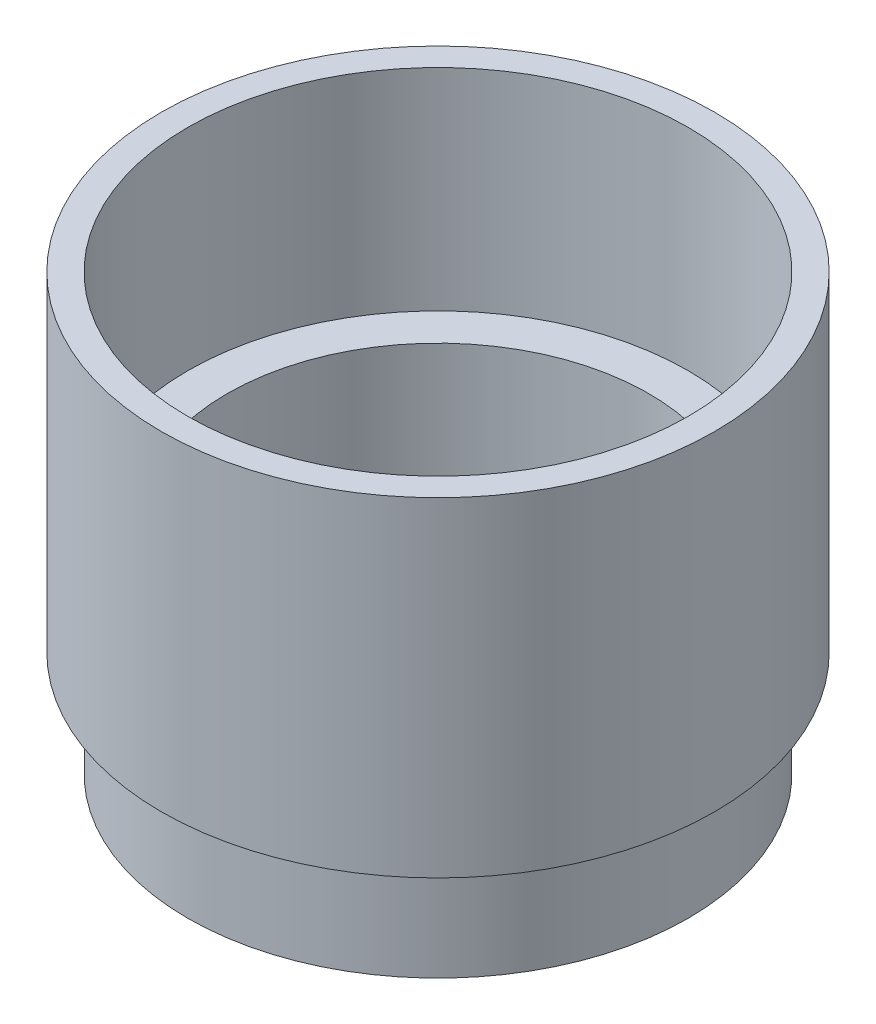
ISO-10303-21;
HEADER;
FILE_DESCRIPTION(('STEP AP214'),'2;1');
FILE_NAME('part.step','',(''),(''),'','','');
FILE_SCHEMA(('AUTOMOTIVE_DESIGN { 1 0 10303 214 1 1 1 1 }'));
ENDSEC;
DATA;
#1=APPLICATION_CONTEXT('core data for automotive mechanical design processes');
#2=APPLICATION_PROTOCOL_DEFINITION('international standard','automotive_design',2000,#1);
#3=PRODUCT_CONTEXT('',#1,'mechanical');
#4=PRODUCT('Part','Part','',(#3));
#5=PRODUCT_RELATED_PRODUCT_CATEGORY('part','',(#4));
#6=PRODUCT_DEFINITION_FORMATION('','',#4);
#7=PRODUCT_DEFINITION_CONTEXT('part definition',#1,'design');
#8=PRODUCT_DEFINITION('design','',#6,#7);
#9=PRODUCT_DEFINITION_SHAPE('','',#8);
#10=(LENGTH_UNIT() NAMED_UNIT(*) SI_UNIT(.MILLI.,.METRE.));
#11=(NAMED_UNIT(*) PLANE_ANGLE_UNIT() SI_UNIT($,.RADIAN.));
#12=(NAMED_UNIT(*) SI_UNIT($,.STERADIAN.) SOLID_ANGLE_UNIT());
#13=UNCERTAINTY_MEASURE_WITH_UNIT(LENGTH_MEASURE(1.E-05),#10,'distance_accuracy_value','');
#14=(GEOMETRIC_REPRESENTATION_CONTEXT(3) GLOBAL_UNCERTAINTY_ASSIGNED_CONTEXT((#13)) GLOBAL_UNIT_ASSIGNED_CONTEXT((#10,
#11,#12)) REPRESENTATION_CONTEXT('',''));
#15=CARTESIAN_POINT('',(0.,0.,0.));
#16=DIRECTION('',(0.,0.,1.));
#17=DIRECTION('',(1.,0.,0.));
#18=AXIS2_PLACEMENT_3D('',#15,#16,#17);
#19=CARTESIAN_POINT('',(0.,-44.45,0.));
#20=DIRECTION('',(0.,-1.,0.));
#21=DIRECTION('',(1.,0.,0.));
#22=AXIS2_PLACEMENT_3D('',#19,#20,#21);
#23=PLANE('',#22);
#24=CARTESIAN_POINT('',(0.,-44.45,0.));
#25=DIRECTION('',(0.,1.,0.));
#26=DIRECTION('',(-1.,0.,0.));
#27=AXIS2_PLACEMENT_3D('',#24,#25,#26);
#28=CIRCLE('',#27,25.4);
#29=CARTESIAN_POINT('',(-25.4,-44.45,0.));
#30=VERTEX_POINT('',#29);
#31=EDGE_CURVE('E11',#30,#30,#28,.T.);
#32=ORIENTED_EDGE('',*,*,#31,.T.);
#33=EDGE_LOOP('',(#32));
#34=FACE_BOUND('',#33,.T.);
#35=CARTESIAN_POINT('',(12.7,-44.45,-12.7));
#36=DIRECTION('',(0.,1.,0.));
#37=DIRECTION('',(0.,0.,1.));
#38=AXIS2_PLACEMENT_3D('',#35,#36,#37);
#39=CIRCLE('',#38,3.175);
#40=CARTESIAN_POINT('',(15.875,-44.45,-12.7));
#41=VERTEX_POINT('',#40);
#42=CARTESIAN_POINT('',(12.7,-44.45,-15.875));
#43=VERTEX_POINT('',#42);
#44=EDGE_CURVE('E133',#41,#43,#39,.T.);
#45=ORIENTED_EDGE('',*,*,#44,.F.);
#46=DIRECTION('',(0.,0.,-1.));
#47=VECTOR('',#46,1.);
#48=CARTESIAN_POINT('',(15.875,-44.45,12.7));
#49=LINE('',#48,#47);
#50=CARTESIAN_POINT('',(15.875,-44.45,12.7));
#51=VERTEX_POINT('',#50);
#52=EDGE_CURVE('E149',#51,#41,#49,.T.);
#53=ORIENTED_EDGE('',*,*,#52,.F.);
#54=CARTESIAN_POINT('',(12.7,-44.45,12.7));
#55=DIRECTION('',(0.,1.,0.));
#56=DIRECTION('',(0.,0.,-1.));
#57=AXIS2_PLACEMENT_3D('',#54,#55,#56);
#58=CIRCLE('',#57,3.175);
#59=CARTESIAN_POINT('',(12.7,-44.45,15.875));
#60=VERTEX_POINT('',#59);
#61=EDGE_CURVE('E49',#60,#51,#58,.T.);
#62=ORIENTED_EDGE('',*,*,#61,.F.);
#63=DIRECTION('',(1.,0.,0.));
#64=VECTOR('',#63,1.);
#65=CARTESIAN_POINT('',(12.7,-44.45,15.875));
#66=LINE('',#65,#64);
#67=CARTESIAN_POINT('',(-12.7,-44.45,15.875));
#68=VERTEX_POINT('',#67);
#69=EDGE_CURVE('E111',#68,#60,#66,.T.);
#70=ORIENTED_EDGE('',*,*,#69,.F.);
#71=CARTESIAN_POINT('',(-12.7,-44.45,12.7));
#72=DIRECTION('',(0.,1.,0.));
#73=DIRECTION('',(0.,0.,1.));
#74=AXIS2_PLACEMENT_3D('',#71,#72,#73);
#75=CIRCLE('',#74,3.175);
#76=CARTESIAN_POINT('',(-15.875,-44.45,12.7));
#77=VERTEX_POINT('',#76);
#78=EDGE_CURVE('E144',#77,#68,#75,.T.);
#79=ORIENTED_EDGE('',*,*,#78,.F.);
#80=DIRECTION('',(0.,0.,1.));
#81=VECTOR('',#80,1.);
#82=CARTESIAN_POINT('',(-15.875,-44.45,12.7));
#83=LINE('',#82,#81);
#84=CARTESIAN_POINT('',(-15.875,-44.45,-12.7));
#85=VERTEX_POINT('',#84);
#86=EDGE_CURVE('E141',#85,#77,#83,.T.);
#87=ORIENTED_EDGE('',*,*,#86,.F.);
#88=CARTESIAN_POINT('',(-12.7,-44.45,-12.7));
#89=DIRECTION('',(0.,1.,0.));
#90=DIRECTION('',(0.,0.,1.));
#91=AXIS2_PLACEMENT_3D('',#88,#89,#90);
#92=CIRCLE('',#91,3.175);
#93=CARTESIAN_POINT('',(-12.7,-44.45,-15.875));
#94=VERTEX_POINT('',#93);
#95=EDGE_CURVE('E138',#94,#85,#92,.T.);
#96=ORIENTED_EDGE('',*,*,#95,.F.);
#97=DIRECTION('',(-1.,0.,0.));
#98=VECTOR('',#97,1.);
#99=CARTESIAN_POINT('',(12.7,-44.45,-15.875));
#100=LINE('',#99,#98);
#101=EDGE_CURVE('E135',#43,#94,#100,.T.);
#102=ORIENTED_EDGE('',*,*,#101,.F.);
#103=EDGE_LOOP('',(#45,#53,#62,#70,#79,#87,#96,#102));
#104=FACE_BOUND('',#103,.T.);
#105=ADVANCED_FACE('F35',(#34,#104),#23,.F.);
#106=CARTESIAN_POINT('',(0.,-44.45,0.));
#107=DIRECTION('',(0.,1.,0.));
#108=DIRECTION('',(-1.,0.,0.));
#109=AXIS2_PLACEMENT_3D('',#106,#107,#108);
#110=CYLINDRICAL_SURFACE('',#109,25.4);
#111=ORIENTED_EDGE('',*,*,#31,.F.);
#112=EDGE_LOOP('',(#111));
#113=FACE_BOUND('',#112,.T.);
#114=CARTESIAN_POINT('',(0.,-25.4,0.));
#115=DIRECTION('',(0.,1.,0.));
#116=DIRECTION('',(-1.,0.,0.));
#117=AXIS2_PLACEMENT_3D('',#114,#115,#116);
#118=CIRCLE('',#117,25.4);
#119=CARTESIAN_POINT('',(-25.4,-25.4,0.));
#120=VERTEX_POINT('',#119);
#121=EDGE_CURVE('E42',#120,#120,#118,.T.);
#122=ORIENTED_EDGE('',*,*,#121,.T.);
#123=EDGE_LOOP('',(#122));
#124=FACE_BOUND('',#123,.T.);
#125=ADVANCED_FACE('F182',(#113,#124),#110,.F.);
#126=CARTESIAN_POINT('',(25.4,-25.4,0.));
#127=DIRECTION('',(0.,-1.,0.));
#128=DIRECTION('',(1.,0.,0.));
#129=AXIS2_PLACEMENT_3D('',#126,#127,#128);
#130=PLANE('',#129);
#131=ORIENTED_EDGE('',*,*,#121,.F.);
#132=EDGE_LOOP('',(#131));
#133=FACE_BOUND('',#132,.T.);
#134=CARTESIAN_POINT('',(0.,-25.4,0.));
#135=DIRECTION('',(0.,1.,0.));
#136=DIRECTION('',(-1.,0.,0.));
#137=AXIS2_PLACEMENT_3D('',#134,#135,#136);
#138=CIRCLE('',#137,30.1625);
#139=CARTESIAN_POINT('',(-30.1625,-25.4,0.));
#140=VERTEX_POINT('',#139);
#141=EDGE_CURVE('E177',#140,#140,#138,.T.);
#142=ORIENTED_EDGE('',*,*,#141,.T.);
#143=EDGE_LOOP('',(#142));
#144=FACE_BOUND('',#143,.T.);
#145=ADVANCED_FACE('F184',(#133,#144),#130,.F.);
#146=CARTESIAN_POINT('',(0.,-44.45,0.));
#147=DIRECTION('',(0.,1.,0.));
#148=DIRECTION('',(-1.,0.,0.));
#149=AXIS2_PLACEMENT_3D('',#146,#147,#148);
#150=CYLINDRICAL_SURFACE('',#149,30.1625);
#151=ORIENTED_EDGE('',*,*,#141,.F.);
#152=EDGE_LOOP('',(#151));
#153=FACE_BOUND('',#152,.T.);
#154=CARTESIAN_POINT('',(0.,0.,0.));
#155=DIRECTION('',(0.,1.,0.));
#156=DIRECTION('',(-1.,0.,0.));
#157=AXIS2_PLACEMENT_3D('',#154,#155,#156);
#158=CIRCLE('',#157,30.1625);
#159=CARTESIAN_POINT('',(-30.1625,0.,0.));
#160=VERTEX_POINT('',#159);
#161=EDGE_CURVE('E174',#160,#160,#158,.T.);
#162=ORIENTED_EDGE('',*,*,#161,.T.);
#163=EDGE_LOOP('',(#162));
#164=FACE_BOUND('',#163,.T.);
#165=ADVANCED_FACE('F187',(#153,#164),#150,.F.);
#166=CARTESIAN_POINT('',(30.1625,0.,0.));
#167=DIRECTION('',(0.,-1.,0.));
#168=DIRECTION('',(1.,0.,0.));
#169=AXIS2_PLACEMENT_3D('',#166,#167,#168);
#170=PLANE('',#169);
#171=ORIENTED_EDGE('',*,*,#161,.F.);
#172=EDGE_LOOP('',(#171));
#173=FACE_BOUND('',#172,.T.);
#174=CARTESIAN_POINT('',(0.,0.,0.));
#175=DIRECTION('',(0.,1.,0.));
#176=DIRECTION('',(-1.,0.,0.));
#177=AXIS2_PLACEMENT_3D('',#174,#175,#176);
#178=CIRCLE('',#177,33.3375);
#179=CARTESIAN_POINT('',(-33.3375,0.,0.));
#180=VERTEX_POINT('',#179);
#181=EDGE_CURVE('E171',#180,#180,#178,.T.);
#182=ORIENTED_EDGE('',*,*,#181,.T.);
#183=EDGE_LOOP('',(#182));
#184=FACE_BOUND('',#183,.T.);
#185=ADVANCED_FACE('F193',(#173,#184),#170,.F.);
#186=CARTESIAN_POINT('',(0.,-44.45,0.));
#187=DIRECTION('',(0.,1.,0.));
#188=DIRECTION('',(-1.,0.,0.));
#189=AXIS2_PLACEMENT_3D('',#186,#187,#188);
#190=CYLINDRICAL_SURFACE('',#189,33.3375);
#191=ORIENTED_EDGE('',*,*,#181,.F.);
#192=EDGE_LOOP('',(#191));
#193=FACE_BOUND('',#192,.T.);
#194=CARTESIAN_POINT('',(0.,-39.6875,0.));
#195=DIRECTION('',(0.,1.,0.));
#196=DIRECTION('',(-1.,0.,0.));
#197=AXIS2_PLACEMENT_3D('',#194,#195,#196);
#198=CIRCLE('',#197,33.3375);
#199=CARTESIAN_POINT('',(-33.3375,-39.6875,0.));
#200=VERTEX_POINT('',#199);
#201=EDGE_CURVE('E168',#200,#200,#198,.T.);
#202=ORIENTED_EDGE('',*,*,#201,.T.);
#203=EDGE_LOOP('',(#202));
#204=FACE_BOUND('',#203,.T.);
#205=ADVANCED_FACE('F199',(#193,#204),#190,.T.);
#206=CARTESIAN_POINT('',(33.3375,-39.6875,0.));
#207=DIRECTION('',(0.,1.,0.));
#208=DIRECTION('',(-1.,0.,0.));
#209=AXIS2_PLACEMENT_3D('',#206,#207,#208);
#210=PLANE('',#209);
#211=ORIENTED_EDGE('',*,*,#201,.F.);
#212=EDGE_LOOP('',(#211));
#213=FACE_BOUND('',#212,.T.);
#214=CARTESIAN_POINT('',(0.,-39.6875,0.));
#215=DIRECTION('',(0.,1.,0.));
#216=DIRECTION('',(-1.,0.,0.));
#217=AXIS2_PLACEMENT_3D('',#214,#215,#216);
#218=CIRCLE('',#217,30.1625);
#219=CARTESIAN_POINT('',(-30.1625,-39.6875,0.));
#220=VERTEX_POINT('',#219);
#221=EDGE_CURVE('E165',#220,#220,#218,.T.);
#222=ORIENTED_EDGE('',*,*,#221,.T.);
#223=EDGE_LOOP('',(#222));
#224=FACE_BOUND('',#223,.T.);
#225=ADVANCED_FACE('F205',(#213,#224),#210,.F.);
#226=CARTESIAN_POINT('',(0.,-44.45,0.));
#227=DIRECTION('',(0.,1.,0.));
#228=DIRECTION('',(-1.,0.,0.));
#229=AXIS2_PLACEMENT_3D('',#226,#227,#228);
#230=CYLINDRICAL_SURFACE('',#229,30.1625);
#231=ORIENTED_EDGE('',*,*,#221,.F.);
#232=EDGE_LOOP('',(#231));
#233=FACE_BOUND('',#232,.T.);
#234=CARTESIAN_POINT('',(0.,-52.3875,0.));
#235=DIRECTION('',(0.,1.,0.));
#236=DIRECTION('',(-1.,0.,0.));
#237=AXIS2_PLACEMENT_3D('',#234,#235,#236);
#238=CIRCLE('',#237,30.1625);
#239=CARTESIAN_POINT('',(-30.1625,-52.3875,0.));
#240=VERTEX_POINT('',#239);
#241=EDGE_CURVE('E153',#240,#240,#238,.T.);
#242=ORIENTED_EDGE('',*,*,#241,.T.);
#243=EDGE_LOOP('',(#242));
#244=FACE_BOUND('',#243,.T.);
#245=ADVANCED_FACE('F211',(#233,#244),#230,.T.);
#246=CARTESIAN_POINT('',(30.1625,-52.3875,0.));
#247=DIRECTION('',(0.,1.,0.));
#248=DIRECTION('',(-1.,0.,0.));
#249=AXIS2_PLACEMENT_3D('',#246,#247,#248);
#250=PLANE('',#249);
#251=ORIENTED_EDGE('',*,*,#241,.F.);
#252=EDGE_LOOP('',(#251));
#253=FACE_BOUND('',#252,.T.);
#254=ADVANCED_FACE('F217',(#253),#250,.F.);
#255=CARTESIAN_POINT('',(12.7,-49.53,-12.7));
#256=DIRECTION('',(0.,1.,0.));
#257=DIRECTION('',(0.,0.,1.));
#258=AXIS2_PLACEMENT_3D('',#255,#256,#257);
#259=CYLINDRICAL_SURFACE('',#258,3.175);
#260=ORIENTED_EDGE('',*,*,#44,.T.);
#261=DIRECTION('',(0.,1.,0.));
#262=VECTOR('',#261,1.);
#263=CARTESIAN_POINT('',(12.7,-49.53,-15.875));
#264=LINE('',#263,#262);
#265=CARTESIAN_POINT('',(12.7,-49.53,-15.875));
#266=VERTEX_POINT('',#265);
#267=EDGE_CURVE('E87',#266,#43,#264,.T.);
#268=ORIENTED_EDGE('',*,*,#267,.F.);
#269=CARTESIAN_POINT('',(12.7,-49.53,-12.7));
#270=DIRECTION('',(0.,1.,0.));
#271=DIRECTION('',(0.,0.,1.));
#272=AXIS2_PLACEMENT_3D('',#269,#270,#271);
#273=CIRCLE('',#272,3.175);
#274=CARTESIAN_POINT('',(15.875,-49.53,-12.7));
#275=VERTEX_POINT('',#274);
#276=EDGE_CURVE('E151',#275,#266,#273,.T.);
#277=ORIENTED_EDGE('',*,*,#276,.F.);
#278=DIRECTION('',(0.,1.,0.));
#279=VECTOR('',#278,1.);
#280=CARTESIAN_POINT('',(15.875,-49.53,-12.7));
#281=LINE('',#280,#279);
#282=EDGE_CURVE('E58',#275,#41,#281,.T.);
#283=ORIENTED_EDGE('',*,*,#282,.T.);
#284=EDGE_LOOP('',(#260,#268,#277,#283));
#285=FACE_BOUND('',#284,.T.);
#286=ADVANCED_FACE('F222',(#285),#259,.F.);
#287=CARTESIAN_POINT('',(15.875,-49.53,12.7));
#288=DIRECTION('',(1.,0.,0.));
#289=DIRECTION('',(0.,0.,-1.));
#290=AXIS2_PLACEMENT_3D('',#287,#288,#289);
#291=PLANE('',#290);
#292=ORIENTED_EDGE('',*,*,#52,.T.);
#293=ORIENTED_EDGE('',*,*,#282,.F.);
#294=DIRECTION('',(0.,0.,-1.));
#295=VECTOR('',#294,1.);
#296=CARTESIAN_POINT('',(15.875,-49.53,12.7));
#297=LINE('',#296,#295);
#298=CARTESIAN_POINT('',(15.875,-49.53,12.7));
#299=VERTEX_POINT('',#298);
#300=EDGE_CURVE('E120',#299,#275,#297,.T.);
#301=ORIENTED_EDGE('',*,*,#300,.F.);
#302=DIRECTION('',(0.,1.,0.));
#303=VECTOR('',#302,1.);
#304=CARTESIAN_POINT('',(15.875,-49.53,12.7));
#305=LINE('',#304,#303);
#306=EDGE_CURVE('E112',#299,#51,#305,.T.);
#307=ORIENTED_EDGE('',*,*,#306,.T.);
#308=EDGE_LOOP('',(#292,#293,#301,#307));
#309=FACE_BOUND('',#308,.T.);
#310=ADVANCED_FACE('F227',(#309),#291,.F.);
#311=CARTESIAN_POINT('',(12.7,-49.53,12.7));
#312=DIRECTION('',(0.,1.,0.));
#313=DIRECTION('',(0.,0.,1.));
#314=AXIS2_PLACEMENT_3D('',#311,#312,#313);
#315=CYLINDRICAL_SURFACE('',#314,3.175);
#316=ORIENTED_EDGE('',*,*,#61,.T.);
#317=ORIENTED_EDGE('',*,*,#306,.F.);
#318=CARTESIAN_POINT('',(12.7,-49.53,12.7));
#319=DIRECTION('',(0.,1.,0.));
#320=DIRECTION('',(0.,0.,-1.));
#321=AXIS2_PLACEMENT_3D('',#318,#319,#320);
#322=CIRCLE('',#321,3.175);
#323=CARTESIAN_POINT('',(12.7,-49.53,15.875));
#324=VERTEX_POINT('',#323);
#325=EDGE_CURVE('E116',#324,#299,#322,.T.);
#326=ORIENTED_EDGE('',*,*,#325,.F.);
#327=DIRECTION('',(0.,1.,0.));
#328=VECTOR('',#327,1.);
#329=CARTESIAN_POINT('',(12.7,-49.53,15.875));
#330=LINE('',#329,#328);
#331=EDGE_CURVE('E104',#324,#60,#330,.T.);
#332=ORIENTED_EDGE('',*,*,#331,.T.);
#333=EDGE_LOOP('',(#316,#317,#326,#332));
#334=FACE_BOUND('',#333,.T.);
#335=ADVANCED_FACE('F117',(#334),#315,.F.);
#336=CARTESIAN_POINT('',(12.7,-49.53,15.875));
#337=DIRECTION('',(0.,0.,1.));
#338=DIRECTION('',(1.,0.,0.));
#339=AXIS2_PLACEMENT_3D('',#336,#337,#338);
#340=PLANE('',#339);
#341=ORIENTED_EDGE('',*,*,#69,.T.);
#342=ORIENTED_EDGE('',*,*,#331,.F.);
#343=DIRECTION('',(1.,0.,0.));
#344=VECTOR('',#343,1.);
#345=CARTESIAN_POINT('',(12.7,-49.53,15.875));
#346=LINE('',#345,#344);
#347=CARTESIAN_POINT('',(-12.7,-49.53,15.875));
#348=VERTEX_POINT('',#347);
#349=EDGE_CURVE('E108',#348,#324,#346,.T.);
#350=ORIENTED_EDGE('',*,*,#349,.F.);
#351=DIRECTION('',(0.,1.,0.));
#352=VECTOR('',#351,1.);
#353=CARTESIAN_POINT('',(-12.7,-49.53,15.875));
#354=LINE('',#353,#352);
#355=EDGE_CURVE('E113',#348,#68,#354,.T.);
#356=ORIENTED_EDGE('',*,*,#355,.T.);
#357=EDGE_LOOP('',(#341,#342,#350,#356));
#358=FACE_BOUND('',#357,.T.);
#359=ADVANCED_FACE('F106',(#358),#340,.F.);
#360=CARTESIAN_POINT('',(-12.7,-49.53,12.7));
#361=DIRECTION('',(0.,1.,0.));
#362=DIRECTION('',(0.,0.,1.));
#363=AXIS2_PLACEMENT_3D('',#360,#361,#362);
#364=CYLINDRICAL_SURFACE('',#363,3.175);
#365=ORIENTED_EDGE('',*,*,#78,.T.);
#366=ORIENTED_EDGE('',*,*,#355,.F.);
#367=CARTESIAN_POINT('',(-12.7,-49.53,12.7));
#368=DIRECTION('',(0.,1.,0.));
#369=DIRECTION('',(0.,0.,1.));
#370=AXIS2_PLACEMENT_3D('',#367,#368,#369);
#371=CIRCLE('',#370,3.175);
#372=CARTESIAN_POINT('',(-15.875,-49.53,12.7));
#373=VERTEX_POINT('',#372);
#374=EDGE_CURVE('E126',#373,#348,#371,.T.);
#375=ORIENTED_EDGE('',*,*,#374,.F.);
#376=DIRECTION('',(0.,1.,0.));
#377=VECTOR('',#376,1.);
#378=CARTESIAN_POINT('',(-15.875,-49.53,12.7));
#379=LINE('',#378,#377);
#380=EDGE_CURVE('E156',#373,#77,#379,.T.);
#381=ORIENTED_EDGE('',*,*,#380,.T.);
#382=EDGE_LOOP('',(#365,#366,#375,#381));
#383=FACE_BOUND('',#382,.T.);
#384=ADVANCED_FACE('F257',(#383),#364,.F.);
#385=CARTESIAN_POINT('',(-15.875,-49.53,12.7));
#386=DIRECTION('',(-1.,0.,0.));
#387=DIRECTION('',(0.,0.,1.));
#388=AXIS2_PLACEMENT_3D('',#385,#386,#387);
#389=PLANE('',#388);
#390=ORIENTED_EDGE('',*,*,#86,.T.);
#391=ORIENTED_EDGE('',*,*,#380,.F.);
#392=DIRECTION('',(0.,0.,1.));
#393=VECTOR('',#392,1.);
#394=CARTESIAN_POINT('',(-15.875,-49.53,12.7));
#395=LINE('',#394,#393);
#396=CARTESIAN_POINT('',(-15.875,-49.53,-12.7));
#397=VERTEX_POINT('',#396);
#398=EDGE_CURVE('E128',#397,#373,#395,.T.);
#399=ORIENTED_EDGE('',*,*,#398,.F.);
#400=DIRECTION('',(0.,1.,0.));
#401=VECTOR('',#400,1.);
#402=CARTESIAN_POINT('',(-15.875,-49.53,-12.7));
#403=LINE('',#402,#401);
#404=EDGE_CURVE('E158',#397,#85,#403,.T.);
#405=ORIENTED_EDGE('',*,*,#404,.T.);
#406=EDGE_LOOP('',(#390,#391,#399,#405));
#407=FACE_BOUND('',#406,.T.);
#408=ADVANCED_FACE('F254',(#407),#389,.F.);
#409=CARTESIAN_POINT('',(-12.7,-49.53,-12.7));
#410=DIRECTION('',(0.,1.,0.));
#411=DIRECTION('',(0.,0.,1.));
#412=AXIS2_PLACEMENT_3D('',#409,#410,#411);
#413=CYLINDRICAL_SURFACE('',#412,3.175);
#414=ORIENTED_EDGE('',*,*,#95,.T.);
#415=ORIENTED_EDGE('',*,*,#404,.F.);
#416=CARTESIAN_POINT('',(-12.7,-49.53,-12.7));
#417=DIRECTION('',(0.,1.,0.));
#418=DIRECTION('',(0.,0.,1.));
#419=AXIS2_PLACEMENT_3D('',#416,#417,#418);
#420=CIRCLE('',#419,3.175);
#421=CARTESIAN_POINT('',(-12.7,-49.53,-15.875));
#422=VERTEX_POINT('',#421);
#423=EDGE_CURVE('E248',#422,#397,#420,.T.);
#424=ORIENTED_EDGE('',*,*,#423,.F.);
#425=DIRECTION('',(0.,1.,0.));
#426=VECTOR('',#425,1.);
#427=CARTESIAN_POINT('',(-12.7,-49.53,-15.875));
#428=LINE('',#427,#426);
#429=EDGE_CURVE('E160',#422,#94,#428,.T.);
#430=ORIENTED_EDGE('',*,*,#429,.T.);
#431=EDGE_LOOP('',(#414,#415,#424,#430));
#432=FACE_BOUND('',#431,.T.);
#433=ADVANCED_FACE('F264',(#432),#413,.F.);
#434=CARTESIAN_POINT('',(12.7,-49.53,-15.875));
#435=DIRECTION('',(0.,0.,-1.));
#436=DIRECTION('',(-1.,0.,0.));
#437=AXIS2_PLACEMENT_3D('',#434,#435,#436);
#438=PLANE('',#437);
#439=ORIENTED_EDGE('',*,*,#101,.T.);
#440=ORIENTED_EDGE('',*,*,#429,.F.);
#441=DIRECTION('',(-1.,0.,0.));
#442=VECTOR('',#441,1.);
#443=CARTESIAN_POINT('',(12.7,-49.53,-15.875));
#444=LINE('',#443,#442);
#445=EDGE_CURVE('E246',#266,#422,#444,.T.);
#446=ORIENTED_EDGE('',*,*,#445,.F.);
#447=ORIENTED_EDGE('',*,*,#267,.T.);
#448=EDGE_LOOP('',(#439,#440,#446,#447));
#449=FACE_BOUND('',#448,.T.);
#450=ADVANCED_FACE('F243',(#449),#438,.F.);
#451=CARTESIAN_POINT('',(12.7,-49.53,-12.7));
#452=DIRECTION('',(0.,1.,0.));
#453=DIRECTION('',(0.,0.,1.));
#454=AXIS2_PLACEMENT_3D('',#451,#452,#453);
#455=PLANE('',#454);
#456=ORIENTED_EDGE('',*,*,#276,.T.);
#457=ORIENTED_EDGE('',*,*,#445,.T.);
#458=ORIENTED_EDGE('',*,*,#423,.T.);
#459=ORIENTED_EDGE('',*,*,#398,.T.);
#460=ORIENTED_EDGE('',*,*,#374,.T.);
#461=ORIENTED_EDGE('',*,*,#349,.T.);
#462=ORIENTED_EDGE('',*,*,#325,.T.);
#463=ORIENTED_EDGE('',*,*,#300,.T.);
#464=EDGE_LOOP('',(#456,#457,#458,#459,#460,#461,#462,#463));
#465=FACE_BOUND('',#464,.T.);
#466=ADVANCED_FACE('F123',(#465),#455,.T.);
#467=CLOSED_SHELL('',(#105,#125,#145,#165,#185,#205,#225,#245,#254,#286,#310,#335,#359,#384,
#408,#433,#450,#466));
#468=MANIFOLD_SOLID_BREP('B2',#467);
#469=ADVANCED_BREP_SHAPE_REPRESENTATION('',(#18,#468),#14);
#470=SHAPE_DEFINITION_REPRESENTATION(#9,#469);
ENDSEC;
END-ISO-10303-21;
